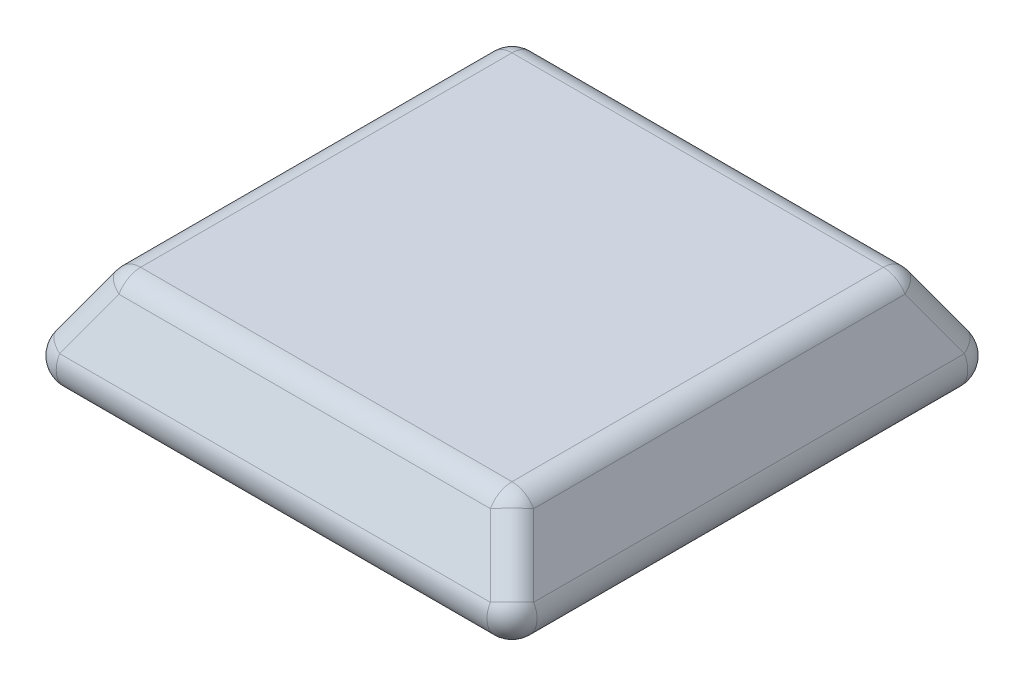
ISO-10303-21;
HEADER;
FILE_DESCRIPTION(('STEP AP214'),'2;1');
FILE_NAME('part.step','',(''),(''),'','','');
FILE_SCHEMA(('AUTOMOTIVE_DESIGN { 1 0 10303 214 1 1 1 1 }'));
ENDSEC;
DATA;
#1=APPLICATION_CONTEXT('core data for automotive mechanical design processes');
#2=APPLICATION_PROTOCOL_DEFINITION('international standard','automotive_design',2000,#1);
#3=PRODUCT_CONTEXT('',#1,'mechanical');
#4=PRODUCT('Part','Part','',(#3));
#5=PRODUCT_RELATED_PRODUCT_CATEGORY('part','',(#4));
#6=PRODUCT_DEFINITION_FORMATION('','',#4);
#7=PRODUCT_DEFINITION_CONTEXT('part definition',#1,'design');
#8=PRODUCT_DEFINITION('design','',#6,#7);
#9=PRODUCT_DEFINITION_SHAPE('','',#8);
#10=(LENGTH_UNIT() NAMED_UNIT(*) SI_UNIT(.MILLI.,.METRE.));
#11=(NAMED_UNIT(*) PLANE_ANGLE_UNIT() SI_UNIT($,.RADIAN.));
#12=(NAMED_UNIT(*) SI_UNIT($,.STERADIAN.) SOLID_ANGLE_UNIT());
#13=UNCERTAINTY_MEASURE_WITH_UNIT(LENGTH_MEASURE(1.E-05),#10,'distance_accuracy_value','');
#14=(GEOMETRIC_REPRESENTATION_CONTEXT(3) GLOBAL_UNCERTAINTY_ASSIGNED_CONTEXT((#13)) GLOBAL_UNIT_ASSIGNED_CONTEXT((#10,
#11,#12)) REPRESENTATION_CONTEXT('',''));
#15=CARTESIAN_POINT('',(0.,0.,0.));
#16=DIRECTION('',(0.,0.,1.));
#17=DIRECTION('',(1.,0.,0.));
#18=AXIS2_PLACEMENT_3D('',#15,#16,#17);
#19=CARTESIAN_POINT('',(3100.,0.,-3100.));
#20=DIRECTION('',(0.866025403784438,0.500000000000001,0.));
#21=DIRECTION('',(-0.500000000000001,0.866025403784438,0.));
#22=AXIS2_PLACEMENT_3D('',#19,#20,#21);
#23=PLANE('',#22);
#24=DIRECTION('',(-0.447213595499959,0.774596669241483,-0.447213595499959));
#25=VECTOR('',#24,1.);
#26=CARTESIAN_POINT('',(1911.96152422706,2057.74300138541,1652.15390309173));
#27=LINE('',#26,#25);
#28=CARTESIAN_POINT('',(2484.54461304386,1066.,2224.73699190852));
#29=VERTEX_POINT('',#28);
#30=CARTESIAN_POINT('',(2840.19237886467,450.,2580.38475772934));
#31=VERTEX_POINT('',#30);
#32=EDGE_CURVE('E217',#29,#31,#27,.F.);
#33=ORIENTED_EDGE('',*,*,#32,.T.);
#34=DIRECTION('',(0.,0.,-1.));
#35=VECTOR('',#34,1.);
#36=CARTESIAN_POINT('',(2840.19237886467,450.,-3100.));
#37=LINE('',#36,#35);
#38=CARTESIAN_POINT('',(2840.19237886467,450.,-2580.38475772934));
#39=VERTEX_POINT('',#38);
#40=EDGE_CURVE('E224',#31,#39,#37,.T.);
#41=ORIENTED_EDGE('',*,*,#40,.T.);
#42=DIRECTION('',(-0.447213595499959,0.774596669241483,0.447213595499959));
#43=VECTOR('',#42,1.);
#44=CARTESIAN_POINT('',(3151.96152422707,-90.,-2892.15390309173));
#45=LINE('',#44,#43);
#46=CARTESIAN_POINT('',(2484.54461304386,1066.,-2224.73699190852));
#47=VERTEX_POINT('',#46);
#48=EDGE_CURVE('E221',#39,#47,#45,.T.);
#49=ORIENTED_EDGE('',*,*,#48,.T.);
#50=DIRECTION('',(0.,0.,-1.));
#51=VECTOR('',#50,1.);
#52=CARTESIAN_POINT('',(2484.54461304386,1066.,2397.94207266541));
#53=LINE('',#52,#51);
#54=EDGE_CURVE('E222',#47,#29,#53,.F.);
#55=ORIENTED_EDGE('',*,*,#54,.T.);
#56=EDGE_LOOP('',(#33,#41,#49,#55));
#57=FACE_BOUND('',#56,.T.);
#58=ADVANCED_FACE('F36',(#57),#23,.T.);
#59=CARTESIAN_POINT('',(-3100.,0.,-3100.));
#60=DIRECTION('',(0.,0.500000000000001,-0.866025403784438));
#61=DIRECTION('',(0.,0.866025403784438,0.500000000000001));
#62=AXIS2_PLACEMENT_3D('',#59,#60,#61);
#63=PLANE('',#62);
#64=DIRECTION('',(-0.447213595499959,0.774596669241483,0.447213595499959));
#65=VECTOR('',#64,1.);
#66=CARTESIAN_POINT('',(1652.15390309173,2057.74300138541,-1911.96152422706));
#67=LINE('',#66,#65);
#68=CARTESIAN_POINT('',(2224.73699190852,1066.,-2484.54461304386));
#69=VERTEX_POINT('',#68);
#70=CARTESIAN_POINT('',(2580.38475772934,450.,-2840.19237886467));
#71=VERTEX_POINT('',#70);
#72=EDGE_CURVE('E137',#69,#71,#67,.F.);
#73=ORIENTED_EDGE('',*,*,#72,.T.);
#74=DIRECTION('',(-1.,0.,0.));
#75=VECTOR('',#74,1.);
#76=CARTESIAN_POINT('',(-3100.,450.,-2840.19237886467));
#77=LINE('',#76,#75);
#78=CARTESIAN_POINT('',(-2580.38475772934,450.,-2840.19237886467));
#79=VERTEX_POINT('',#78);
#80=EDGE_CURVE('E133',#71,#79,#77,.T.);
#81=ORIENTED_EDGE('',*,*,#80,.T.);
#82=DIRECTION('',(0.447213595499959,0.774596669241483,0.447213595499959));
#83=VECTOR('',#82,1.);
#84=CARTESIAN_POINT('',(-2892.15390309174,-90.,-3151.96152422707));
#85=LINE('',#84,#83);
#86=CARTESIAN_POINT('',(-2224.73699190853,1066.,-2484.54461304386));
#87=VERTEX_POINT('',#86);
#88=EDGE_CURVE('E128',#79,#87,#85,.T.);
#89=ORIENTED_EDGE('',*,*,#88,.T.);
#90=DIRECTION('',(-1.,0.,0.));
#91=VECTOR('',#90,1.);
#92=CARTESIAN_POINT('',(2397.94207266541,1066.,-2484.54461304386));
#93=LINE('',#92,#91);
#94=EDGE_CURVE('E131',#87,#69,#93,.F.);
#95=ORIENTED_EDGE('',*,*,#94,.T.);
#96=EDGE_LOOP('',(#73,#81,#89,#95));
#97=FACE_BOUND('',#96,.T.);
#98=ADVANCED_FACE('F130',(#97),#63,.T.);
#99=CARTESIAN_POINT('',(-3100.,0.,-3100.));
#100=DIRECTION('',(-0.866025403784438,0.500000000000001,0.));
#101=DIRECTION('',(-0.500000000000001,-0.866025403784438,0.));
#102=AXIS2_PLACEMENT_3D('',#99,#100,#101);
#103=PLANE('',#102);
#104=DIRECTION('',(0.447213595499959,0.774596669241483,0.447213595499959));
#105=VECTOR('',#104,1.);
#106=CARTESIAN_POINT('',(-3151.96152422707,-90.,-2892.15390309173));
#107=LINE('',#106,#105);
#108=CARTESIAN_POINT('',(-2484.54461304386,1066.,-2224.73699190852));
#109=VERTEX_POINT('',#108);
#110=CARTESIAN_POINT('',(-2840.19237886467,450.,-2580.38475772934));
#111=VERTEX_POINT('',#110);
#112=EDGE_CURVE('E155',#109,#111,#107,.F.);
#113=ORIENTED_EDGE('',*,*,#112,.T.);
#114=DIRECTION('',(0.,0.,1.));
#115=VECTOR('',#114,1.);
#116=CARTESIAN_POINT('',(-2840.19237886467,450.,-3100.));
#117=LINE('',#116,#115);
#118=CARTESIAN_POINT('',(-2840.19237886467,450.,2580.38475772934));
#119=VERTEX_POINT('',#118);
#120=EDGE_CURVE('E243',#111,#119,#117,.T.);
#121=ORIENTED_EDGE('',*,*,#120,.T.);
#122=DIRECTION('',(0.447213595499959,0.774596669241483,-0.447213595499959));
#123=VECTOR('',#122,1.);
#124=CARTESIAN_POINT('',(-1911.96152422706,2057.74300138541,1652.15390309173));
#125=LINE('',#124,#123);
#126=CARTESIAN_POINT('',(-2484.54461304386,1066.,2224.73699190853));
#127=VERTEX_POINT('',#126);
#128=EDGE_CURVE('E240',#119,#127,#125,.T.);
#129=ORIENTED_EDGE('',*,*,#128,.T.);
#130=DIRECTION('',(0.,0.,1.));
#131=VECTOR('',#130,1.);
#132=CARTESIAN_POINT('',(-2484.54461304386,1066.,-2397.94207266541));
#133=LINE('',#132,#131);
#134=EDGE_CURVE('E238',#127,#109,#133,.F.);
#135=ORIENTED_EDGE('',*,*,#134,.T.);
#136=EDGE_LOOP('',(#113,#121,#129,#135));
#137=FACE_BOUND('',#136,.T.);
#138=ADVANCED_FACE('F299',(#137),#103,.T.);
#139=CARTESIAN_POINT('',(-3100.,0.,3100.));
#140=DIRECTION('',(0.,0.500000000000001,0.866025403784438));
#141=DIRECTION('',(0.,-0.866025403784438,0.500000000000001));
#142=AXIS2_PLACEMENT_3D('',#139,#140,#141);
#143=PLANE('',#142);
#144=DIRECTION('',(0.447213595499959,0.774596669241483,-0.447213595499959));
#145=VECTOR('',#144,1.);
#146=CARTESIAN_POINT('',(-2892.15390309174,-90.,3151.96152422707));
#147=LINE('',#146,#145);
#148=CARTESIAN_POINT('',(-2224.73699190853,1066.,2484.54461304386));
#149=VERTEX_POINT('',#148);
#150=CARTESIAN_POINT('',(-2580.38475772934,450.,2840.19237886467));
#151=VERTEX_POINT('',#150);
#152=EDGE_CURVE('E234',#149,#151,#147,.F.);
#153=ORIENTED_EDGE('',*,*,#152,.T.);
#154=DIRECTION('',(1.,0.,0.));
#155=VECTOR('',#154,1.);
#156=CARTESIAN_POINT('',(-3100.,450.,2840.19237886467));
#157=LINE('',#156,#155);
#158=CARTESIAN_POINT('',(2580.38475772934,450.,2840.19237886467));
#159=VERTEX_POINT('',#158);
#160=EDGE_CURVE('E236',#151,#159,#157,.T.);
#161=ORIENTED_EDGE('',*,*,#160,.T.);
#162=DIRECTION('',(-0.447213595499959,0.774596669241483,-0.447213595499959));
#163=VECTOR('',#162,1.);
#164=CARTESIAN_POINT('',(1652.15390309173,2057.74300138541,1911.96152422706));
#165=LINE('',#164,#163);
#166=CARTESIAN_POINT('',(2224.73699190852,1066.,2484.54461304386));
#167=VERTEX_POINT('',#166);
#168=EDGE_CURVE('E215',#159,#167,#165,.T.);
#169=ORIENTED_EDGE('',*,*,#168,.T.);
#170=DIRECTION('',(1.,0.,0.));
#171=VECTOR('',#170,1.);
#172=CARTESIAN_POINT('',(-2397.94207266541,1066.,2484.54461304386));
#173=LINE('',#172,#171);
#174=EDGE_CURVE('E231',#167,#149,#173,.F.);
#175=ORIENTED_EDGE('',*,*,#174,.T.);
#176=EDGE_LOOP('',(#153,#161,#169,#175));
#177=FACE_BOUND('',#176,.T.);
#178=ADVANCED_FACE('F304',(#177),#143,.T.);
#179=CARTESIAN_POINT('',(0.,1216.,0.));
#180=DIRECTION('',(0.,1.,0.));
#181=DIRECTION('',(0.,0.,1.));
#182=AXIS2_PLACEMENT_3D('',#179,#180,#181);
#183=PLANE('',#182);
#184=DIRECTION('',(-1.,0.,0.));
#185=VECTOR('',#184,1.);
#186=CARTESIAN_POINT('',(2397.94207266541,1216.,2224.73699190852));
#187=LINE('',#186,#185);
#188=CARTESIAN_POINT('',(-2224.73699190853,1216.,2224.73699190852));
#189=VERTEX_POINT('',#188);
#190=CARTESIAN_POINT('',(2224.73699190852,1216.,2224.73699190852));
#191=VERTEX_POINT('',#190);
#192=EDGE_CURVE('E246',#189,#191,#187,.F.);
#193=ORIENTED_EDGE('',*,*,#192,.T.);
#194=DIRECTION('',(0.,0.,1.));
#195=VECTOR('',#194,1.);
#196=CARTESIAN_POINT('',(2224.73699190852,1216.,-2397.94207266541));
#197=LINE('',#196,#195);
#198=CARTESIAN_POINT('',(2224.73699190852,1216.,-2224.73699190852));
#199=VERTEX_POINT('',#198);
#200=EDGE_CURVE('E11',#191,#199,#197,.F.);
#201=ORIENTED_EDGE('',*,*,#200,.T.);
#202=DIRECTION('',(1.,0.,0.));
#203=VECTOR('',#202,1.);
#204=CARTESIAN_POINT('',(-2397.94207266541,1216.,-2224.73699190852));
#205=LINE('',#204,#203);
#206=CARTESIAN_POINT('',(-2224.73699190853,1216.,-2224.73699190852));
#207=VERTEX_POINT('',#206);
#208=EDGE_CURVE('E45',#199,#207,#205,.F.);
#209=ORIENTED_EDGE('',*,*,#208,.T.);
#210=DIRECTION('',(0.,0.,-1.));
#211=VECTOR('',#210,1.);
#212=CARTESIAN_POINT('',(-2224.73699190853,1216.,2397.94207266541));
#213=LINE('',#212,#211);
#214=EDGE_CURVE('E248',#207,#189,#213,.F.);
#215=ORIENTED_EDGE('',*,*,#214,.T.);
#216=EDGE_LOOP('',(#193,#201,#209,#215));
#217=FACE_BOUND('',#216,.T.);
#218=ADVANCED_FACE('F307',(#217),#183,.T.);
#219=CARTESIAN_POINT('',(0.,0.,0.));
#220=DIRECTION('',(0.,1.,0.));
#221=DIRECTION('',(0.,0.,1.));
#222=AXIS2_PLACEMENT_3D('',#219,#220,#221);
#223=PLANE('',#222);
#224=DIRECTION('',(0.,0.,-1.));
#225=VECTOR('',#224,1.);
#226=CARTESIAN_POINT('',(-2580.38475772934,0.,3.69651944570699E-13));
#227=LINE('',#226,#225);
#228=CARTESIAN_POINT('',(-2580.38475772934,0.,2580.38475772934));
#229=VERTEX_POINT('',#228);
#230=CARTESIAN_POINT('',(-2580.38475772934,0.,-2580.38475772934));
#231=VERTEX_POINT('',#230);
#232=EDGE_CURVE('E282',#229,#231,#227,.T.);
#233=ORIENTED_EDGE('',*,*,#232,.T.);
#234=DIRECTION('',(1.,0.,0.));
#235=VECTOR('',#234,1.);
#236=CARTESIAN_POINT('',(0.,0.,-2580.38475772934));
#237=LINE('',#236,#235);
#238=CARTESIAN_POINT('',(2580.38475772933,0.,-2580.38475772934));
#239=VERTEX_POINT('',#238);
#240=EDGE_CURVE('E226',#231,#239,#237,.T.);
#241=ORIENTED_EDGE('',*,*,#240,.T.);
#242=DIRECTION('',(0.,0.,1.));
#243=VECTOR('',#242,1.);
#244=CARTESIAN_POINT('',(2580.38475772934,0.,-3.69651944570699E-13));
#245=LINE('',#244,#243);
#246=CARTESIAN_POINT('',(2580.38475772934,0.,2580.38475772934));
#247=VERTEX_POINT('',#246);
#248=EDGE_CURVE('E272',#239,#247,#245,.T.);
#249=ORIENTED_EDGE('',*,*,#248,.T.);
#250=DIRECTION('',(-1.,0.,0.));
#251=VECTOR('',#250,1.);
#252=CARTESIAN_POINT('',(0.,0.,2580.38475772934));
#253=LINE('',#252,#251);
#254=EDGE_CURVE('E277',#247,#229,#253,.T.);
#255=ORIENTED_EDGE('',*,*,#254,.T.);
#256=EDGE_LOOP('',(#233,#241,#249,#255));
#257=FACE_BOUND('',#256,.T.);
#258=ADVANCED_FACE('F280',(#257),#223,.F.);
#259=CARTESIAN_POINT('',(0.,916.,2224.73699190852));
#260=DIRECTION('',(1.,0.,0.));
#261=DIRECTION('',(0.,0.,-1.));
#262=AXIS2_PLACEMENT_3D('',#259,#260,#261);
#263=CYLINDRICAL_SURFACE('',#262,300.);
#264=CARTESIAN_POINT('',(2224.73699190852,916.,2224.73699190852));
#265=DIRECTION('',(1.,0.,0.));
#266=DIRECTION('',(0.,0.,-1.));
#267=AXIS2_PLACEMENT_3D('',#264,#265,#266);
#268=CIRCLE('',#267,300.);
#269=EDGE_CURVE('E40',#191,#167,#268,.T.);
#270=ORIENTED_EDGE('',*,*,#269,.F.);
#271=ORIENTED_EDGE('',*,*,#192,.F.);
#272=CARTESIAN_POINT('',(-2224.73699190853,916.,2224.73699190852));
#273=DIRECTION('',(-1.,0.,0.));
#274=DIRECTION('',(0.,-1.,0.));
#275=AXIS2_PLACEMENT_3D('',#272,#273,#274);
#276=CIRCLE('',#275,300.);
#277=EDGE_CURVE('E194',#149,#189,#276,.T.);
#278=ORIENTED_EDGE('',*,*,#277,.F.);
#279=ORIENTED_EDGE('',*,*,#174,.F.);
#280=EDGE_LOOP('',(#270,#271,#278,#279));
#281=FACE_BOUND('',#280,.T.);
#282=ADVANCED_FACE('F38',(#281),#263,.T.);
#283=CARTESIAN_POINT('',(2224.73699190852,916.,2224.73699190852));
#284=DIRECTION('',(0.,0.,1.));
#285=DIRECTION('',(1.,0.,0.));
#286=AXIS2_PLACEMENT_3D('',#283,#284,#285);
#287=SPHERICAL_SURFACE('',#286,300.);
#288=CARTESIAN_POINT('',(2224.73699190852,916.,2224.73699190852));
#289=DIRECTION('',(0.,0.,1.));
#290=DIRECTION('',(1.,0.,0.));
#291=AXIS2_PLACEMENT_3D('',#288,#289,#290);
#292=CIRCLE('',#291,300.);
#293=EDGE_CURVE('E189',#191,#29,#292,.F.);
#294=ORIENTED_EDGE('',*,*,#293,.F.);
#295=ORIENTED_EDGE('',*,*,#269,.T.);
#296=CARTESIAN_POINT('',(2224.73699190852,916.,2224.73699190852));
#297=DIRECTION('',(-0.447213595499959,0.774596669241483,-0.447213595499959));
#298=DIRECTION('',(0.,0.500000000000001,0.866025403784438));
#299=AXIS2_PLACEMENT_3D('',#296,#297,#298);
#300=CIRCLE('',#299,300.);
#301=EDGE_CURVE('E192',#29,#167,#300,.F.);
#302=ORIENTED_EDGE('',*,*,#301,.F.);
#303=EDGE_LOOP('',(#294,#295,#302));
#304=FACE_BOUND('',#303,.T.);
#305=ADVANCED_FACE('F205',(#304),#287,.T.);
#306=CARTESIAN_POINT('',(-2224.73699190853,916.,2224.73699190852));
#307=DIRECTION('',(0.,0.,1.));
#308=DIRECTION('',(1.,0.,0.));
#309=AXIS2_PLACEMENT_3D('',#306,#307,#308);
#310=SPHERICAL_SURFACE('',#309,300.);
#311=CARTESIAN_POINT('',(-2224.73699190853,916.,2224.73699190853));
#312=DIRECTION('',(0.447213595499959,0.774596669241483,-0.447213595499959));
#313=DIRECTION('',(0.,0.500000000000001,0.866025403784438));
#314=AXIS2_PLACEMENT_3D('',#311,#312,#313);
#315=CIRCLE('',#314,300.);
#316=EDGE_CURVE('E183',#149,#127,#315,.F.);
#317=ORIENTED_EDGE('',*,*,#316,.F.);
#318=ORIENTED_EDGE('',*,*,#277,.T.);
#319=CARTESIAN_POINT('',(-2224.73699190853,916.,2224.73699190852));
#320=DIRECTION('',(0.,0.,1.));
#321=DIRECTION('',(1.,0.,0.));
#322=AXIS2_PLACEMENT_3D('',#319,#320,#321);
#323=CIRCLE('',#322,300.);
#324=EDGE_CURVE('E186',#127,#189,#323,.F.);
#325=ORIENTED_EDGE('',*,*,#324,.F.);
#326=EDGE_LOOP('',(#317,#318,#325));
#327=FACE_BOUND('',#326,.T.);
#328=ADVANCED_FACE('F364',(#327),#310,.T.);
#329=CARTESIAN_POINT('',(1652.15390309173,1907.74300138541,1652.15390309173));
#330=DIRECTION('',(0.447213595499959,-0.774596669241482,0.447213595499959));
#331=DIRECTION('',(0.866025403784438,0.500000000000001,0.));
#332=AXIS2_PLACEMENT_3D('',#329,#330,#331);
#333=CYLINDRICAL_SURFACE('',#332,300.);
#334=ORIENTED_EDGE('',*,*,#301,.T.);
#335=ORIENTED_EDGE('',*,*,#168,.F.);
#336=CARTESIAN_POINT('',(2580.38475772934,300.,2580.38475772934));
#337=DIRECTION('',(0.447213595499959,-0.774596669241483,0.447213595499959));
#338=DIRECTION('',(0.,-0.500000000000001,-0.866025403784438));
#339=AXIS2_PLACEMENT_3D('',#336,#337,#338);
#340=CIRCLE('',#339,300.);
#341=EDGE_CURVE('E178',#31,#159,#340,.T.);
#342=ORIENTED_EDGE('',*,*,#341,.F.);
#343=ORIENTED_EDGE('',*,*,#32,.F.);
#344=EDGE_LOOP('',(#334,#335,#342,#343));
#345=FACE_BOUND('',#344,.T.);
#346=ADVANCED_FACE('F213',(#345),#333,.T.);
#347=CARTESIAN_POINT('',(2224.73699190852,916.,-3.18703771890601E-13));
#348=DIRECTION('',(0.,0.,-1.));
#349=DIRECTION('',(-1.,0.,0.));
#350=AXIS2_PLACEMENT_3D('',#347,#348,#349);
#351=CYLINDRICAL_SURFACE('',#350,300.);
#352=ORIENTED_EDGE('',*,*,#293,.T.);
#353=ORIENTED_EDGE('',*,*,#54,.F.);
#354=CARTESIAN_POINT('',(2224.73699190852,916.,-2224.73699190852));
#355=DIRECTION('',(0.,0.,-1.));
#356=DIRECTION('',(-1.,0.,0.));
#357=AXIS2_PLACEMENT_3D('',#354,#355,#356);
#358=CIRCLE('',#357,300.);
#359=EDGE_CURVE('E176',#199,#47,#358,.T.);
#360=ORIENTED_EDGE('',*,*,#359,.F.);
#361=ORIENTED_EDGE('',*,*,#200,.F.);
#362=EDGE_LOOP('',(#352,#353,#360,#361));
#363=FACE_BOUND('',#362,.T.);
#364=ADVANCED_FACE('F358',(#363),#351,.T.);
#365=CARTESIAN_POINT('',(0.,916.,-2224.73699190852));
#366=DIRECTION('',(-1.,0.,0.));
#367=DIRECTION('',(0.,0.,1.));
#368=AXIS2_PLACEMENT_3D('',#365,#366,#367);
#369=CYLINDRICAL_SURFACE('',#368,300.);
#370=CARTESIAN_POINT('',(-2224.73699190853,916.,-2224.73699190852));
#371=DIRECTION('',(-1.,0.,0.));
#372=DIRECTION('',(0.,0.,1.));
#373=AXIS2_PLACEMENT_3D('',#370,#371,#372);
#374=CIRCLE('',#373,300.);
#375=EDGE_CURVE('E143',#207,#87,#374,.T.);
#376=ORIENTED_EDGE('',*,*,#375,.F.);
#377=ORIENTED_EDGE('',*,*,#208,.F.);
#378=CARTESIAN_POINT('',(2224.73699190852,916.,-2224.73699190852));
#379=DIRECTION('',(1.,0.,0.));
#380=DIRECTION('',(0.,1.,0.));
#381=AXIS2_PLACEMENT_3D('',#378,#379,#380);
#382=CIRCLE('',#381,300.);
#383=EDGE_CURVE('E53',#69,#199,#382,.T.);
#384=ORIENTED_EDGE('',*,*,#383,.F.);
#385=ORIENTED_EDGE('',*,*,#94,.F.);
#386=EDGE_LOOP('',(#376,#377,#384,#385));
#387=FACE_BOUND('',#386,.T.);
#388=ADVANCED_FACE('F142',(#387),#369,.T.);
#389=CARTESIAN_POINT('',(-2224.73699190853,916.,3.18703771890601E-13));
#390=DIRECTION('',(0.,0.,1.));
#391=DIRECTION('',(1.,0.,0.));
#392=AXIS2_PLACEMENT_3D('',#389,#390,#391);
#393=CYLINDRICAL_SURFACE('',#392,300.);
#394=ORIENTED_EDGE('',*,*,#324,.T.);
#395=ORIENTED_EDGE('',*,*,#214,.F.);
#396=CARTESIAN_POINT('',(-2224.73699190853,916.,-2224.73699190852));
#397=DIRECTION('',(0.,0.,-1.));
#398=DIRECTION('',(-1.,0.,0.));
#399=AXIS2_PLACEMENT_3D('',#396,#397,#398);
#400=CIRCLE('',#399,300.);
#401=EDGE_CURVE('E152',#109,#207,#400,.T.);
#402=ORIENTED_EDGE('',*,*,#401,.F.);
#403=ORIENTED_EDGE('',*,*,#134,.F.);
#404=EDGE_LOOP('',(#394,#395,#402,#403));
#405=FACE_BOUND('',#404,.T.);
#406=ADVANCED_FACE('F351',(#405),#393,.T.);
#407=CARTESIAN_POINT('',(-2892.15390309174,-240.,2892.15390309173));
#408=DIRECTION('',(-0.447213595499958,-0.774596669241482,0.447213595499959));
#409=DIRECTION('',(0.,-0.500000000000001,-0.866025403784438));
#410=AXIS2_PLACEMENT_3D('',#407,#408,#409);
#411=CYLINDRICAL_SURFACE('',#410,300.);
#412=ORIENTED_EDGE('',*,*,#316,.T.);
#413=ORIENTED_EDGE('',*,*,#128,.F.);
#414=CARTESIAN_POINT('',(-2580.38475772934,300.,2580.38475772934));
#415=DIRECTION('',(-0.447213595499958,-0.774596669241483,0.447213595499959));
#416=DIRECTION('',(0.,-0.500000000000001,-0.866025403784438));
#417=AXIS2_PLACEMENT_3D('',#414,#415,#416);
#418=CIRCLE('',#417,300.);
#419=EDGE_CURVE('E171',#151,#119,#418,.T.);
#420=ORIENTED_EDGE('',*,*,#419,.F.);
#421=ORIENTED_EDGE('',*,*,#152,.F.);
#422=EDGE_LOOP('',(#412,#413,#420,#421));
#423=FACE_BOUND('',#422,.T.);
#424=ADVANCED_FACE('F347',(#423),#411,.T.);
#425=CARTESIAN_POINT('',(-3100.,300.,2580.38475772934));
#426=DIRECTION('',(-1.,0.,0.));
#427=DIRECTION('',(0.,0.,1.));
#428=AXIS2_PLACEMENT_3D('',#425,#426,#427);
#429=CYLINDRICAL_SURFACE('',#428,300.);
#430=CARTESIAN_POINT('',(2580.38475772934,300.,2580.38475772934));
#431=DIRECTION('',(1.,0.,0.));
#432=DIRECTION('',(0.,0.,-1.));
#433=AXIS2_PLACEMENT_3D('',#430,#431,#432);
#434=CIRCLE('',#433,300.);
#435=EDGE_CURVE('E180',#159,#247,#434,.T.);
#436=ORIENTED_EDGE('',*,*,#435,.F.);
#437=ORIENTED_EDGE('',*,*,#160,.F.);
#438=CARTESIAN_POINT('',(-2580.38475772934,300.,2580.38475772934));
#439=DIRECTION('',(-1.,0.,0.));
#440=DIRECTION('',(0.,0.,1.));
#441=AXIS2_PLACEMENT_3D('',#438,#439,#440);
#442=CIRCLE('',#441,300.);
#443=EDGE_CURVE('E168',#229,#151,#442,.T.);
#444=ORIENTED_EDGE('',*,*,#443,.F.);
#445=ORIENTED_EDGE('',*,*,#254,.F.);
#446=EDGE_LOOP('',(#436,#437,#444,#445));
#447=FACE_BOUND('',#446,.T.);
#448=ADVANCED_FACE('F343',(#447),#429,.T.);
#449=CARTESIAN_POINT('',(2580.38475772934,300.,2580.38475772934));
#450=DIRECTION('',(0.,0.,1.));
#451=DIRECTION('',(1.,0.,0.));
#452=AXIS2_PLACEMENT_3D('',#449,#450,#451);
#453=SPHERICAL_SURFACE('',#452,300.);
#454=ORIENTED_EDGE('',*,*,#341,.T.);
#455=ORIENTED_EDGE('',*,*,#435,.T.);
#456=CARTESIAN_POINT('',(2580.38475772934,300.,2580.38475772934));
#457=DIRECTION('',(0.,0.,1.));
#458=DIRECTION('',(1.,0.,0.));
#459=AXIS2_PLACEMENT_3D('',#456,#457,#458);
#460=CIRCLE('',#459,300.);
#461=EDGE_CURVE('E160',#31,#247,#460,.F.);
#462=ORIENTED_EDGE('',*,*,#461,.F.);
#463=EDGE_LOOP('',(#454,#455,#462));
#464=FACE_BOUND('',#463,.T.);
#465=ADVANCED_FACE('F340',(#464),#453,.T.);
#466=CARTESIAN_POINT('',(2224.73699190852,916.,-2224.73699190852));
#467=DIRECTION('',(0.,0.,1.));
#468=DIRECTION('',(1.,0.,0.));
#469=AXIS2_PLACEMENT_3D('',#466,#467,#468);
#470=SPHERICAL_SURFACE('',#469,300.);
#471=ORIENTED_EDGE('',*,*,#383,.T.);
#472=ORIENTED_EDGE('',*,*,#359,.T.);
#473=CARTESIAN_POINT('',(2224.73699190852,916.,-2224.73699190852));
#474=DIRECTION('',(-0.447213595499959,0.774596669241483,0.447213595499958));
#475=DIRECTION('',(-0.866025403784438,-0.500000000000001,0.));
#476=AXIS2_PLACEMENT_3D('',#473,#474,#475);
#477=CIRCLE('',#476,300.);
#478=EDGE_CURVE('E156',#69,#47,#477,.F.);
#479=ORIENTED_EDGE('',*,*,#478,.F.);
#480=EDGE_LOOP('',(#471,#472,#479));
#481=FACE_BOUND('',#480,.T.);
#482=ADVANCED_FACE('F337',(#481),#470,.T.);
#483=CARTESIAN_POINT('',(-2224.73699190853,916.,-2224.73699190852));
#484=DIRECTION('',(0.,0.,1.));
#485=DIRECTION('',(1.,0.,0.));
#486=AXIS2_PLACEMENT_3D('',#483,#484,#485);
#487=SPHERICAL_SURFACE('',#486,300.);
#488=ORIENTED_EDGE('',*,*,#401,.T.);
#489=ORIENTED_EDGE('',*,*,#375,.T.);
#490=CARTESIAN_POINT('',(-2224.73699190853,916.,-2224.73699190852));
#491=DIRECTION('',(0.447213595499959,0.774596669241483,0.447213595499959));
#492=DIRECTION('',(0.,-0.500000000000001,0.866025403784438));
#493=AXIS2_PLACEMENT_3D('',#490,#491,#492);
#494=CIRCLE('',#493,300.);
#495=EDGE_CURVE('E149',#109,#87,#494,.F.);
#496=ORIENTED_EDGE('',*,*,#495,.F.);
#497=EDGE_LOOP('',(#488,#489,#496));
#498=FACE_BOUND('',#497,.T.);
#499=ADVANCED_FACE('F148',(#498),#487,.T.);
#500=CARTESIAN_POINT('',(-2580.38475772934,300.,2580.38475772934));
#501=DIRECTION('',(0.,0.,1.));
#502=DIRECTION('',(1.,0.,0.));
#503=AXIS2_PLACEMENT_3D('',#500,#501,#502);
#504=SPHERICAL_SURFACE('',#503,300.);
#505=ORIENTED_EDGE('',*,*,#443,.T.);
#506=ORIENTED_EDGE('',*,*,#419,.T.);
#507=CARTESIAN_POINT('',(-2580.38475772934,300.,2580.38475772934));
#508=DIRECTION('',(0.,0.,1.));
#509=DIRECTION('',(0.,-1.,0.));
#510=AXIS2_PLACEMENT_3D('',#507,#508,#509);
#511=CIRCLE('',#510,300.);
#512=EDGE_CURVE('E157',#229,#119,#511,.F.);
#513=ORIENTED_EDGE('',*,*,#512,.F.);
#514=EDGE_LOOP('',(#505,#506,#513));
#515=FACE_BOUND('',#514,.T.);
#516=ADVANCED_FACE('F331',(#515),#504,.T.);
#517=CARTESIAN_POINT('',(2580.38475772933,300.,-3100.));
#518=DIRECTION('',(0.,0.,1.));
#519=DIRECTION('',(1.,0.,0.));
#520=AXIS2_PLACEMENT_3D('',#517,#518,#519);
#521=CYLINDRICAL_SURFACE('',#520,300.);
#522=ORIENTED_EDGE('',*,*,#461,.T.);
#523=ORIENTED_EDGE('',*,*,#248,.F.);
#524=CARTESIAN_POINT('',(2580.38475772933,300.,-2580.38475772934));
#525=DIRECTION('',(0.,0.,-1.));
#526=DIRECTION('',(-1.,0.,0.));
#527=AXIS2_PLACEMENT_3D('',#524,#525,#526);
#528=CIRCLE('',#527,300.);
#529=EDGE_CURVE('E162',#39,#239,#528,.T.);
#530=ORIENTED_EDGE('',*,*,#529,.F.);
#531=ORIENTED_EDGE('',*,*,#40,.F.);
#532=EDGE_LOOP('',(#522,#523,#530,#531));
#533=FACE_BOUND('',#532,.T.);
#534=ADVANCED_FACE('F274',(#533),#521,.T.);
#535=CARTESIAN_POINT('',(1652.15390309173,1907.74300138541,-1652.15390309173));
#536=DIRECTION('',(0.447213595499958,-0.774596669241482,-0.447213595499959));
#537=DIRECTION('',(0.,0.500000000000001,-0.866025403784438));
#538=AXIS2_PLACEMENT_3D('',#535,#536,#537);
#539=CYLINDRICAL_SURFACE('',#538,300.);
#540=ORIENTED_EDGE('',*,*,#478,.T.);
#541=ORIENTED_EDGE('',*,*,#48,.F.);
#542=CARTESIAN_POINT('',(2580.38475772934,300.,-2580.38475772934));
#543=DIRECTION('',(0.447213595499959,-0.774596669241482,-0.447213595499958));
#544=DIRECTION('',(0.866025403784438,0.500000000000002,0.));
#545=AXIS2_PLACEMENT_3D('',#542,#543,#544);
#546=CIRCLE('',#545,300.);
#547=EDGE_CURVE('E261',#71,#39,#546,.T.);
#548=ORIENTED_EDGE('',*,*,#547,.F.);
#549=ORIENTED_EDGE('',*,*,#72,.F.);
#550=EDGE_LOOP('',(#540,#541,#548,#549));
#551=FACE_BOUND('',#550,.T.);
#552=ADVANCED_FACE('F292',(#551),#539,.T.);
#553=CARTESIAN_POINT('',(-2892.15390309174,-240.,-2892.15390309173));
#554=DIRECTION('',(-0.447213595499959,-0.774596669241482,-0.447213595499959));
#555=DIRECTION('',(0.866025403784438,-0.500000000000001,0.));
#556=AXIS2_PLACEMENT_3D('',#553,#554,#555);
#557=CYLINDRICAL_SURFACE('',#556,300.);
#558=ORIENTED_EDGE('',*,*,#495,.T.);
#559=ORIENTED_EDGE('',*,*,#88,.F.);
#560=CARTESIAN_POINT('',(-2580.38475772934,300.,-2580.38475772934));
#561=DIRECTION('',(-0.447213595499959,-0.774596669241483,-0.447213595499959));
#562=DIRECTION('',(0.,0.500000000000001,-0.866025403784438));
#563=AXIS2_PLACEMENT_3D('',#560,#561,#562);
#564=CIRCLE('',#563,300.);
#565=EDGE_CURVE('E258',#111,#79,#564,.T.);
#566=ORIENTED_EDGE('',*,*,#565,.F.);
#567=ORIENTED_EDGE('',*,*,#112,.F.);
#568=EDGE_LOOP('',(#558,#559,#566,#567));
#569=FACE_BOUND('',#568,.T.);
#570=ADVANCED_FACE('F154',(#569),#557,.T.);
#571=CARTESIAN_POINT('',(-2580.38475772934,300.,-3100.));
#572=DIRECTION('',(0.,0.,-1.));
#573=DIRECTION('',(-1.,0.,0.));
#574=AXIS2_PLACEMENT_3D('',#571,#572,#573);
#575=CYLINDRICAL_SURFACE('',#574,300.);
#576=ORIENTED_EDGE('',*,*,#512,.T.);
#577=ORIENTED_EDGE('',*,*,#120,.F.);
#578=CARTESIAN_POINT('',(-2580.38475772934,300.,-2580.38475772934));
#579=DIRECTION('',(0.,0.,-1.));
#580=DIRECTION('',(-1.,0.,0.));
#581=AXIS2_PLACEMENT_3D('',#578,#579,#580);
#582=CIRCLE('',#581,300.);
#583=EDGE_CURVE('E255',#231,#111,#582,.T.);
#584=ORIENTED_EDGE('',*,*,#583,.F.);
#585=ORIENTED_EDGE('',*,*,#232,.F.);
#586=EDGE_LOOP('',(#576,#577,#584,#585));
#587=FACE_BOUND('',#586,.T.);
#588=ADVANCED_FACE('F321',(#587),#575,.T.);
#589=CARTESIAN_POINT('',(2580.38475772933,300.,-2580.38475772934));
#590=DIRECTION('',(0.,0.,1.));
#591=DIRECTION('',(1.,0.,0.));
#592=AXIS2_PLACEMENT_3D('',#589,#590,#591);
#593=SPHERICAL_SURFACE('',#592,300.);
#594=ORIENTED_EDGE('',*,*,#547,.T.);
#595=ORIENTED_EDGE('',*,*,#529,.T.);
#596=CARTESIAN_POINT('',(2580.38475772933,300.,-2580.38475772934));
#597=DIRECTION('',(1.,0.,0.));
#598=DIRECTION('',(0.,0.,-1.));
#599=AXIS2_PLACEMENT_3D('',#596,#597,#598);
#600=CIRCLE('',#599,300.);
#601=EDGE_CURVE('E253',#71,#239,#600,.F.);
#602=ORIENTED_EDGE('',*,*,#601,.F.);
#603=EDGE_LOOP('',(#594,#595,#602));
#604=FACE_BOUND('',#603,.T.);
#605=ADVANCED_FACE('F267',(#604),#593,.T.);
#606=CARTESIAN_POINT('',(-2580.38475772934,300.,-2580.38475772934));
#607=DIRECTION('',(0.,0.,1.));
#608=DIRECTION('',(1.,0.,0.));
#609=AXIS2_PLACEMENT_3D('',#606,#607,#608);
#610=SPHERICAL_SURFACE('',#609,300.);
#611=ORIENTED_EDGE('',*,*,#583,.T.);
#612=ORIENTED_EDGE('',*,*,#565,.T.);
#613=CARTESIAN_POINT('',(-2580.38475772934,300.,-2580.38475772934));
#614=DIRECTION('',(-1.,0.,0.));
#615=DIRECTION('',(0.,0.,1.));
#616=AXIS2_PLACEMENT_3D('',#613,#614,#615);
#617=CIRCLE('',#616,300.);
#618=EDGE_CURVE('E251',#231,#79,#617,.F.);
#619=ORIENTED_EDGE('',*,*,#618,.F.);
#620=EDGE_LOOP('',(#611,#612,#619));
#621=FACE_BOUND('',#620,.T.);
#622=ADVANCED_FACE('F315',(#621),#610,.T.);
#623=CARTESIAN_POINT('',(-3100.,300.,-2580.38475772934));
#624=DIRECTION('',(1.,0.,0.));
#625=DIRECTION('',(0.,0.,-1.));
#626=AXIS2_PLACEMENT_3D('',#623,#624,#625);
#627=CYLINDRICAL_SURFACE('',#626,300.);
#628=ORIENTED_EDGE('',*,*,#601,.T.);
#629=ORIENTED_EDGE('',*,*,#240,.F.);
#630=ORIENTED_EDGE('',*,*,#618,.T.);
#631=ORIENTED_EDGE('',*,*,#80,.F.);
#632=EDGE_LOOP('',(#628,#629,#630,#631));
#633=FACE_BOUND('',#632,.T.);
#634=ADVANCED_FACE('F312',(#633),#627,.T.);
#635=CLOSED_SHELL('',(#58,#98,#138,#178,#218,#258,#282,#305,#328,#346,#364,#388,#406,#424,#448,
#465,#482,#499,#516,#534,#552,#570,#588,#605,#622,#634));
#636=MANIFOLD_SOLID_BREP('B2',#635);
#637=ADVANCED_BREP_SHAPE_REPRESENTATION('',(#18,#636),#14);
#638=SHAPE_DEFINITION_REPRESENTATION(#9,#637);
ENDSEC;
END-ISO-10303-21;
